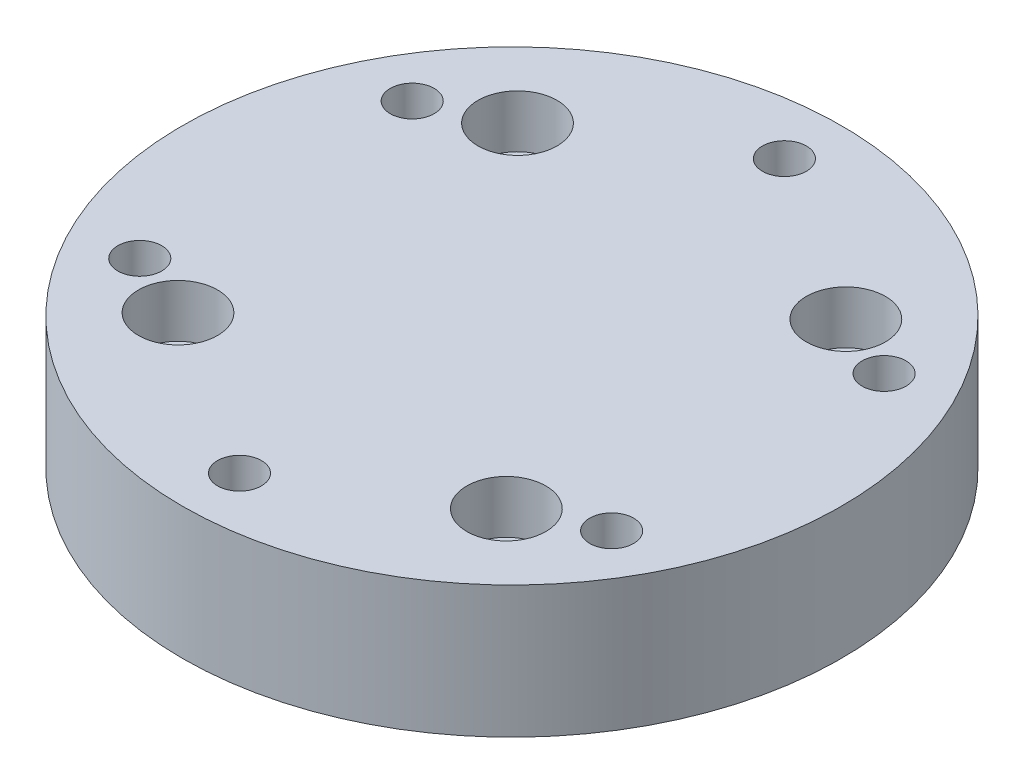
ISO-10303-21;
HEADER;
FILE_DESCRIPTION(('STEP AP214'),'2;1');
FILE_NAME('part.step','',(''),(''),'','','');
FILE_SCHEMA(('AUTOMOTIVE_DESIGN { 1 0 10303 214 1 1 1 1 }'));
ENDSEC;
DATA;
#1=APPLICATION_CONTEXT('core data for automotive mechanical design processes');
#2=APPLICATION_PROTOCOL_DEFINITION('international standard','automotive_design',2000,#1);
#3=PRODUCT_CONTEXT('',#1,'mechanical');
#4=PRODUCT('Part','Part','',(#3));
#5=PRODUCT_RELATED_PRODUCT_CATEGORY('part','',(#4));
#6=PRODUCT_DEFINITION_FORMATION('','',#4);
#7=PRODUCT_DEFINITION_CONTEXT('part definition',#1,'design');
#8=PRODUCT_DEFINITION('design','',#6,#7);
#9=PRODUCT_DEFINITION_SHAPE('','',#8);
#10=(LENGTH_UNIT() NAMED_UNIT(*) SI_UNIT(.MILLI.,.METRE.));
#11=(NAMED_UNIT(*) PLANE_ANGLE_UNIT() SI_UNIT($,.RADIAN.));
#12=(NAMED_UNIT(*) SI_UNIT($,.STERADIAN.) SOLID_ANGLE_UNIT());
#13=UNCERTAINTY_MEASURE_WITH_UNIT(LENGTH_MEASURE(1.E-05),#10,'distance_accuracy_value','');
#14=(GEOMETRIC_REPRESENTATION_CONTEXT(3) GLOBAL_UNCERTAINTY_ASSIGNED_CONTEXT((#13)) GLOBAL_UNIT_ASSIGNED_CONTEXT((#10,
#11,#12)) REPRESENTATION_CONTEXT('',''));
#15=CARTESIAN_POINT('',(0.,0.,0.));
#16=DIRECTION('',(0.,0.,1.));
#17=DIRECTION('',(1.,0.,0.));
#18=AXIS2_PLACEMENT_3D('',#15,#16,#17);
#19=CARTESIAN_POINT('',(-18.6792441284836,15.,-19.3154193791129));
#20=DIRECTION('',(0.,-1.,0.));
#21=DIRECTION('',(0.,0.,-1.));
#22=AXIS2_PLACEMENT_3D('',#19,#20,#21);
#23=CYLINDRICAL_SURFACE('',#22,2.5);
#24=CARTESIAN_POINT('',(-18.6792441284836,0.,-19.3154193791129));
#25=DIRECTION('',(0.,1.,0.));
#26=DIRECTION('',(0.,0.,1.));
#27=AXIS2_PLACEMENT_3D('',#24,#25,#26);
#28=CIRCLE('',#27,2.5);
#29=CARTESIAN_POINT('',(-18.6792441284836,0.,-16.8154193791129));
#30=VERTEX_POINT('',#29);
#31=EDGE_CURVE('E49',#30,#30,#28,.T.);
#32=ORIENTED_EDGE('',*,*,#31,.F.);
#33=EDGE_LOOP('',(#32));
#34=FACE_BOUND('',#33,.T.);
#35=CARTESIAN_POINT('',(-18.6792441284836,9.,-19.3154193791129));
#36=DIRECTION('',(0.,1.,0.));
#37=DIRECTION('',(0.,0.,1.));
#38=AXIS2_PLACEMENT_3D('',#35,#36,#37);
#39=CIRCLE('',#38,2.5);
#40=CARTESIAN_POINT('',(-18.6792441284836,9.,-16.8154193791129));
#41=VERTEX_POINT('',#40);
#42=EDGE_CURVE('E40',#41,#41,#39,.T.);
#43=ORIENTED_EDGE('',*,*,#42,.T.);
#44=EDGE_LOOP('',(#43));
#45=FACE_BOUND('',#44,.T.);
#46=ADVANCED_FACE('F36',(#34,#45),#23,.F.);
#47=CARTESIAN_POINT('',(19.3154193791129,15.,-18.6792441284836));
#48=DIRECTION('',(0.,-1.,0.));
#49=DIRECTION('',(0.,0.,-1.));
#50=AXIS2_PLACEMENT_3D('',#47,#48,#49);
#51=CYLINDRICAL_SURFACE('',#50,2.50000000000048);
#52=CARTESIAN_POINT('',(19.3154193791129,0.,-18.6792441284836));
#53=DIRECTION('',(0.,1.,0.));
#54=DIRECTION('',(0.,0.,1.));
#55=AXIS2_PLACEMENT_3D('',#52,#53,#54);
#56=CIRCLE('',#55,2.50000000000048);
#57=CARTESIAN_POINT('',(19.3154193791129,0.,-16.1792441284831));
#58=VERTEX_POINT('',#57);
#59=EDGE_CURVE('E74',#58,#58,#56,.T.);
#60=ORIENTED_EDGE('',*,*,#59,.F.);
#61=EDGE_LOOP('',(#60));
#62=FACE_BOUND('',#61,.T.);
#63=CARTESIAN_POINT('',(19.3154193791129,9.,-18.6792441284836));
#64=DIRECTION('',(0.,1.,0.));
#65=DIRECTION('',(0.,0.,1.));
#66=AXIS2_PLACEMENT_3D('',#63,#64,#65);
#67=CIRCLE('',#66,2.50000000000048);
#68=CARTESIAN_POINT('',(19.3154193791129,9.,-16.1792441284831));
#69=VERTEX_POINT('',#68);
#70=EDGE_CURVE('E60',#69,#69,#67,.T.);
#71=ORIENTED_EDGE('',*,*,#70,.T.);
#72=EDGE_LOOP('',(#71));
#73=FACE_BOUND('',#72,.T.);
#74=ADVANCED_FACE('F88',(#62,#73),#51,.F.);
#75=CARTESIAN_POINT('',(18.6792441284836,15.,19.3154193791129));
#76=DIRECTION('',(0.,-1.,0.));
#77=DIRECTION('',(0.,0.,-1.));
#78=AXIS2_PLACEMENT_3D('',#75,#76,#77);
#79=CYLINDRICAL_SURFACE('',#78,2.50000000000145);
#80=CARTESIAN_POINT('',(18.6792441284836,0.,19.3154193791129));
#81=DIRECTION('',(0.,1.,0.));
#82=DIRECTION('',(0.,0.,1.));
#83=AXIS2_PLACEMENT_3D('',#80,#81,#82);
#84=CIRCLE('',#83,2.50000000000145);
#85=CARTESIAN_POINT('',(18.6792441284836,0.,21.8154193791144));
#86=VERTEX_POINT('',#85);
#87=EDGE_CURVE('E69',#86,#86,#84,.T.);
#88=ORIENTED_EDGE('',*,*,#87,.F.);
#89=EDGE_LOOP('',(#88));
#90=FACE_BOUND('',#89,.T.);
#91=CARTESIAN_POINT('',(18.6792441284836,9.,19.3154193791129));
#92=DIRECTION('',(0.,1.,0.));
#93=DIRECTION('',(0.,0.,1.));
#94=AXIS2_PLACEMENT_3D('',#91,#92,#93);
#95=CIRCLE('',#94,2.50000000000145);
#96=CARTESIAN_POINT('',(18.6792441284836,9.,21.8154193791144));
#97=VERTEX_POINT('',#96);
#98=EDGE_CURVE('E57',#97,#97,#95,.T.);
#99=ORIENTED_EDGE('',*,*,#98,.T.);
#100=EDGE_LOOP('',(#99));
#101=FACE_BOUND('',#100,.T.);
#102=ADVANCED_FACE('F93',(#90,#101),#79,.F.);
#103=CARTESIAN_POINT('',(-19.3154193791129,15.,18.6792441284836));
#104=DIRECTION('',(0.,-1.,0.));
#105=DIRECTION('',(0.,0.,-1.));
#106=AXIS2_PLACEMENT_3D('',#103,#104,#105);
#107=CYLINDRICAL_SURFACE('',#106,2.50000000000097);
#108=CARTESIAN_POINT('',(-19.3154193791129,0.,18.6792441284836));
#109=DIRECTION('',(0.,1.,0.));
#110=DIRECTION('',(0.,0.,1.));
#111=AXIS2_PLACEMENT_3D('',#108,#109,#110);
#112=CIRCLE('',#111,2.50000000000097);
#113=CARTESIAN_POINT('',(-19.3154193791129,0.,21.1792441284846));
#114=VERTEX_POINT('',#113);
#115=EDGE_CURVE('E65',#114,#114,#112,.T.);
#116=ORIENTED_EDGE('',*,*,#115,.F.);
#117=EDGE_LOOP('',(#116));
#118=FACE_BOUND('',#117,.T.);
#119=CARTESIAN_POINT('',(-19.3154193791129,9.,18.6792441284836));
#120=DIRECTION('',(0.,1.,0.));
#121=DIRECTION('',(0.,0.,1.));
#122=AXIS2_PLACEMENT_3D('',#119,#120,#121);
#123=CIRCLE('',#122,2.50000000000097);
#124=CARTESIAN_POINT('',(-19.3154193791129,9.,21.1792441284846));
#125=VERTEX_POINT('',#124);
#126=EDGE_CURVE('E54',#125,#125,#123,.T.);
#127=ORIENTED_EDGE('',*,*,#126,.T.);
#128=EDGE_LOOP('',(#127));
#129=FACE_BOUND('',#128,.T.);
#130=ADVANCED_FACE('F100',(#118,#129),#107,.F.);
#131=CARTESIAN_POINT('',(0.,15.,0.));
#132=DIRECTION('',(0.,1.,0.));
#133=DIRECTION('',(0.,0.,1.));
#134=AXIS2_PLACEMENT_3D('',#131,#132,#133);
#135=PLANE('',#134);
#136=CARTESIAN_POINT('',(0.,15.,-31.));
#137=DIRECTION('',(0.,1.,0.));
#138=DIRECTION('',(0.,0.,1.));
#139=AXIS2_PLACEMENT_3D('',#136,#137,#138);
#140=CIRCLE('',#139,2.49999999999999);
#141=CARTESIAN_POINT('',(0.,15.,-28.5));
#142=VERTEX_POINT('',#141);
#143=EDGE_CURVE('E403',#142,#142,#140,.T.);
#144=ORIENTED_EDGE('',*,*,#143,.F.);
#145=EDGE_LOOP('',(#144));
#146=FACE_BOUND('',#145,.T.);
#147=CARTESIAN_POINT('',(26.8467875173183,15.,-15.5000000000011));
#148=DIRECTION('',(0.,1.,0.));
#149=DIRECTION('',(0.,0.,1.));
#150=AXIS2_PLACEMENT_3D('',#147,#148,#149);
#151=CIRCLE('',#150,2.49999999999999);
#152=CARTESIAN_POINT('',(26.8467875173183,15.,-13.0000000000012));
#153=VERTEX_POINT('',#152);
#154=EDGE_CURVE('E405',#153,#153,#151,.T.);
#155=ORIENTED_EDGE('',*,*,#154,.F.);
#156=EDGE_LOOP('',(#155));
#157=FACE_BOUND('',#156,.T.);
#158=CARTESIAN_POINT('',(26.8467875173196,15.,15.4999999999989));
#159=DIRECTION('',(0.,1.,0.));
#160=DIRECTION('',(0.,0.,1.));
#161=AXIS2_PLACEMENT_3D('',#158,#159,#160);
#162=CIRCLE('',#161,2.49999999999999);
#163=CARTESIAN_POINT('',(26.8467875173196,15.,17.9999999999988));
#164=VERTEX_POINT('',#163);
#165=EDGE_CURVE('E411',#164,#164,#162,.T.);
#166=ORIENTED_EDGE('',*,*,#165,.F.);
#167=EDGE_LOOP('',(#166));
#168=FACE_BOUND('',#167,.T.);
#169=CARTESIAN_POINT('',(2.6318297617955E-12,15.,31.));
#170=DIRECTION('',(0.,1.,0.));
#171=DIRECTION('',(0.,0.,1.));
#172=AXIS2_PLACEMENT_3D('',#169,#170,#171);
#173=CIRCLE('',#172,2.49999999999999);
#174=CARTESIAN_POINT('',(2.6318297617955E-12,15.,33.5));
#175=VERTEX_POINT('',#174);
#176=EDGE_CURVE('E415',#175,#175,#173,.T.);
#177=ORIENTED_EDGE('',*,*,#176,.F.);
#178=EDGE_LOOP('',(#177));
#179=FACE_BOUND('',#178,.T.);
#180=CARTESIAN_POINT('',(-26.8467875173156,15.,15.5000000000012));
#181=DIRECTION('',(0.,1.,0.));
#182=DIRECTION('',(0.,0.,1.));
#183=AXIS2_PLACEMENT_3D('',#180,#181,#182);
#184=CIRCLE('',#183,2.49999999999999);
#185=CARTESIAN_POINT('',(-26.8467875173156,15.,18.0000000000011));
#186=VERTEX_POINT('',#185);
#187=EDGE_CURVE('E419',#186,#186,#184,.T.);
#188=ORIENTED_EDGE('',*,*,#187,.F.);
#189=EDGE_LOOP('',(#188));
#190=FACE_BOUND('',#189,.T.);
#191=CARTESIAN_POINT('',(-26.8467875173169,15.,-15.4999999999989));
#192=DIRECTION('',(0.,1.,0.));
#193=DIRECTION('',(0.,0.,1.));
#194=AXIS2_PLACEMENT_3D('',#191,#192,#193);
#195=CIRCLE('',#194,2.49999999999999);
#196=CARTESIAN_POINT('',(-26.8467875173169,15.,-12.9999999999989));
#197=VERTEX_POINT('',#196);
#198=EDGE_CURVE('E137',#197,#197,#195,.T.);
#199=ORIENTED_EDGE('',*,*,#198,.F.);
#200=EDGE_LOOP('',(#199));
#201=FACE_BOUND('',#200,.T.);
#202=CARTESIAN_POINT('',(-19.3154193791119,15.,18.6792441284836));
#203=DIRECTION('',(0.,1.,0.));
#204=DIRECTION('',(0.,0.,1.));
#205=AXIS2_PLACEMENT_3D('',#202,#203,#204);
#206=CIRCLE('',#205,4.5);
#207=CARTESIAN_POINT('',(-19.3154193791119,15.,23.1792441284836));
#208=VERTEX_POINT('',#207);
#209=EDGE_CURVE('E136',#208,#208,#206,.T.);
#210=ORIENTED_EDGE('',*,*,#209,.F.);
#211=EDGE_LOOP('',(#210));
#212=FACE_BOUND('',#211,.T.);
#213=CARTESIAN_POINT('',(18.6792441284847,15.,19.3154193791119));
#214=DIRECTION('',(0.,1.,0.));
#215=DIRECTION('',(0.,0.,1.));
#216=AXIS2_PLACEMENT_3D('',#213,#214,#215);
#217=CIRCLE('',#216,4.5);
#218=CARTESIAN_POINT('',(18.6792441284847,15.,23.8154193791119));
#219=VERTEX_POINT('',#218);
#220=EDGE_CURVE('E155',#219,#219,#217,.T.);
#221=ORIENTED_EDGE('',*,*,#220,.F.);
#222=EDGE_LOOP('',(#221));
#223=FACE_BOUND('',#222,.T.);
#224=CARTESIAN_POINT('',(19.3154193791129,15.,-18.6792441284847));
#225=DIRECTION('',(0.,1.,0.));
#226=DIRECTION('',(0.,0.,1.));
#227=AXIS2_PLACEMENT_3D('',#224,#225,#226);
#228=CIRCLE('',#227,4.5);
#229=CARTESIAN_POINT('',(19.3154193791129,15.,-14.1792441284847));
#230=VERTEX_POINT('',#229);
#231=EDGE_CURVE('E149',#230,#230,#228,.T.);
#232=ORIENTED_EDGE('',*,*,#231,.F.);
#233=EDGE_LOOP('',(#232));
#234=FACE_BOUND('',#233,.T.);
#235=CARTESIAN_POINT('',(-18.6792441284836,15.,-19.3154193791129));
#236=DIRECTION('',(0.,1.,0.));
#237=DIRECTION('',(0.,0.,1.));
#238=AXIS2_PLACEMENT_3D('',#235,#236,#237);
#239=CIRCLE('',#238,4.5);
#240=CARTESIAN_POINT('',(-18.6792441284836,15.,-14.8154193791129));
#241=VERTEX_POINT('',#240);
#242=EDGE_CURVE('E77',#241,#241,#239,.T.);
#243=ORIENTED_EDGE('',*,*,#242,.F.);
#244=EDGE_LOOP('',(#243));
#245=FACE_BOUND('',#244,.T.);
#246=CARTESIAN_POINT('',(0.,15.,0.));
#247=DIRECTION('',(0.,1.,0.));
#248=DIRECTION('',(0.,0.,1.));
#249=AXIS2_PLACEMENT_3D('',#246,#247,#248);
#250=CIRCLE('',#249,37.5);
#251=CARTESIAN_POINT('',(0.,15.,37.5));
#252=VERTEX_POINT('',#251);
#253=EDGE_CURVE('E10',#252,#252,#250,.T.);
#254=ORIENTED_EDGE('',*,*,#253,.T.);
#255=EDGE_LOOP('',(#254));
#256=FACE_BOUND('',#255,.T.);
#257=ADVANCED_FACE('F98',(#146,#157,#168,#179,#190,#201,#212,#223,#234,#245,#256),#135,.T.);
#258=CARTESIAN_POINT('',(0.,0.,0.));
#259=DIRECTION('',(0.,1.,0.));
#260=DIRECTION('',(0.,0.,1.));
#261=AXIS2_PLACEMENT_3D('',#258,#259,#260);
#262=PLANE('',#261);
#263=CARTESIAN_POINT('',(0.,0.,-31.));
#264=DIRECTION('',(0.,1.,0.));
#265=DIRECTION('',(0.,0.,1.));
#266=AXIS2_PLACEMENT_3D('',#263,#264,#265);
#267=CIRCLE('',#266,2.5);
#268=CARTESIAN_POINT('',(0.,0.,-28.5));
#269=VERTEX_POINT('',#268);
#270=EDGE_CURVE('E112',#269,#269,#267,.T.);
#271=ORIENTED_EDGE('',*,*,#270,.T.);
#272=EDGE_LOOP('',(#271));
#273=FACE_BOUND('',#272,.T.);
#274=CARTESIAN_POINT('',(26.8467875173183,0.,-15.5000000000011));
#275=DIRECTION('',(0.,1.,0.));
#276=DIRECTION('',(0.,0.,1.));
#277=AXIS2_PLACEMENT_3D('',#274,#275,#276);
#278=CIRCLE('',#277,2.5);
#279=CARTESIAN_POINT('',(26.8467875173183,0.,-13.0000000000011));
#280=VERTEX_POINT('',#279);
#281=EDGE_CURVE('E116',#280,#280,#278,.T.);
#282=ORIENTED_EDGE('',*,*,#281,.T.);
#283=EDGE_LOOP('',(#282));
#284=FACE_BOUND('',#283,.T.);
#285=CARTESIAN_POINT('',(26.8467875173196,0.,15.4999999999989));
#286=DIRECTION('',(0.,1.,0.));
#287=DIRECTION('',(0.,0.,1.));
#288=AXIS2_PLACEMENT_3D('',#285,#286,#287);
#289=CIRCLE('',#288,2.5);
#290=CARTESIAN_POINT('',(26.8467875173196,0.,17.9999999999988));
#291=VERTEX_POINT('',#290);
#292=EDGE_CURVE('E120',#291,#291,#289,.T.);
#293=ORIENTED_EDGE('',*,*,#292,.T.);
#294=EDGE_LOOP('',(#293));
#295=FACE_BOUND('',#294,.T.);
#296=CARTESIAN_POINT('',(2.6318297617955E-12,0.,31.));
#297=DIRECTION('',(0.,1.,0.));
#298=DIRECTION('',(0.,0.,1.));
#299=AXIS2_PLACEMENT_3D('',#296,#297,#298);
#300=CIRCLE('',#299,2.5);
#301=CARTESIAN_POINT('',(2.6318297617955E-12,0.,33.5));
#302=VERTEX_POINT('',#301);
#303=EDGE_CURVE('E124',#302,#302,#300,.T.);
#304=ORIENTED_EDGE('',*,*,#303,.T.);
#305=EDGE_LOOP('',(#304));
#306=FACE_BOUND('',#305,.T.);
#307=CARTESIAN_POINT('',(-26.8467875173156,0.,15.5000000000012));
#308=DIRECTION('',(0.,1.,0.));
#309=DIRECTION('',(0.,0.,1.));
#310=AXIS2_PLACEMENT_3D('',#307,#308,#309);
#311=CIRCLE('',#310,2.5);
#312=CARTESIAN_POINT('',(-26.8467875173156,0.,18.0000000000011));
#313=VERTEX_POINT('',#312);
#314=EDGE_CURVE('E128',#313,#313,#311,.T.);
#315=ORIENTED_EDGE('',*,*,#314,.T.);
#316=EDGE_LOOP('',(#315));
#317=FACE_BOUND('',#316,.T.);
#318=CARTESIAN_POINT('',(-26.8467875173169,0.,-15.4999999999989));
#319=DIRECTION('',(0.,1.,0.));
#320=DIRECTION('',(0.,0.,1.));
#321=AXIS2_PLACEMENT_3D('',#318,#319,#320);
#322=CIRCLE('',#321,2.5);
#323=CARTESIAN_POINT('',(-26.8467875173169,0.,-12.9999999999989));
#324=VERTEX_POINT('',#323);
#325=EDGE_CURVE('E132',#324,#324,#322,.T.);
#326=ORIENTED_EDGE('',*,*,#325,.T.);
#327=EDGE_LOOP('',(#326));
#328=FACE_BOUND('',#327,.T.);
#329=CARTESIAN_POINT('',(0.,0.,0.));
#330=DIRECTION('',(0.,1.,0.));
#331=DIRECTION('',(0.,0.,1.));
#332=AXIS2_PLACEMENT_3D('',#329,#330,#331);
#333=CIRCLE('',#332,37.5);
#334=CARTESIAN_POINT('',(0.,0.,37.5));
#335=VERTEX_POINT('',#334);
#336=EDGE_CURVE('E44',#335,#335,#333,.T.);
#337=ORIENTED_EDGE('',*,*,#336,.F.);
#338=EDGE_LOOP('',(#337));
#339=FACE_BOUND('',#338,.T.);
#340=ORIENTED_EDGE('',*,*,#31,.T.);
#341=EDGE_LOOP('',(#340));
#342=FACE_BOUND('',#341,.T.);
#343=ORIENTED_EDGE('',*,*,#59,.T.);
#344=EDGE_LOOP('',(#343));
#345=FACE_BOUND('',#344,.T.);
#346=ORIENTED_EDGE('',*,*,#87,.T.);
#347=EDGE_LOOP('',(#346));
#348=FACE_BOUND('',#347,.T.);
#349=ORIENTED_EDGE('',*,*,#115,.T.);
#350=EDGE_LOOP('',(#349));
#351=FACE_BOUND('',#350,.T.);
#352=ADVANCED_FACE('F85',(#273,#284,#295,#306,#317,#328,#339,#342,#345,#348,#351),#262,.F.);
#353=CARTESIAN_POINT('',(0.,15.,0.));
#354=DIRECTION('',(0.,-1.,0.));
#355=DIRECTION('',(0.,0.,-1.));
#356=AXIS2_PLACEMENT_3D('',#353,#354,#355);
#357=CYLINDRICAL_SURFACE('',#356,37.5);
#358=ORIENTED_EDGE('',*,*,#253,.F.);
#359=EDGE_LOOP('',(#358));
#360=FACE_BOUND('',#359,.T.);
#361=ORIENTED_EDGE('',*,*,#336,.T.);
#362=EDGE_LOOP('',(#361));
#363=FACE_BOUND('',#362,.T.);
#364=ADVANCED_FACE('F38',(#360,#363),#357,.T.);
#365=CARTESIAN_POINT('',(-19.3154193791119,9.,18.6792441284836));
#366=DIRECTION('',(0.,1.,0.));
#367=DIRECTION('',(0.,0.,1.));
#368=AXIS2_PLACEMENT_3D('',#365,#366,#367);
#369=CYLINDRICAL_SURFACE('',#368,4.5);
#370=CARTESIAN_POINT('',(-19.3154193791119,9.,18.6792441284836));
#371=DIRECTION('',(0.,1.,0.));
#372=DIRECTION('',(0.,0.,1.));
#373=AXIS2_PLACEMENT_3D('',#370,#371,#372);
#374=CIRCLE('',#373,4.5);
#375=CARTESIAN_POINT('',(-19.3154193791119,9.,23.1792441284836));
#376=VERTEX_POINT('',#375);
#377=EDGE_CURVE('E140',#376,#376,#374,.T.);
#378=ORIENTED_EDGE('',*,*,#377,.F.);
#379=EDGE_LOOP('',(#378));
#380=FACE_BOUND('',#379,.T.);
#381=ORIENTED_EDGE('',*,*,#209,.T.);
#382=EDGE_LOOP('',(#381));
#383=FACE_BOUND('',#382,.T.);
#384=ADVANCED_FACE('F107',(#380,#383),#369,.F.);
#385=CARTESIAN_POINT('',(-19.3154193791119,9.,18.6792441284836));
#386=DIRECTION('',(0.,1.,0.));
#387=DIRECTION('',(0.,0.,1.));
#388=AXIS2_PLACEMENT_3D('',#385,#386,#387);
#389=PLANE('',#388);
#390=ORIENTED_EDGE('',*,*,#126,.F.);
#391=EDGE_LOOP('',(#390));
#392=FACE_BOUND('',#391,.T.);
#393=ORIENTED_EDGE('',*,*,#377,.T.);
#394=EDGE_LOOP('',(#393));
#395=FACE_BOUND('',#394,.T.);
#396=ADVANCED_FACE('F203',(#392,#395),#389,.T.);
#397=CARTESIAN_POINT('',(18.6792441284847,9.,19.3154193791119));
#398=DIRECTION('',(0.,1.,0.));
#399=DIRECTION('',(0.,0.,1.));
#400=AXIS2_PLACEMENT_3D('',#397,#398,#399);
#401=CYLINDRICAL_SURFACE('',#400,4.5);
#402=CARTESIAN_POINT('',(18.6792441284847,9.,19.3154193791119));
#403=DIRECTION('',(0.,1.,0.));
#404=DIRECTION('',(0.,0.,1.));
#405=AXIS2_PLACEMENT_3D('',#402,#403,#404);
#406=CIRCLE('',#405,4.5);
#407=CARTESIAN_POINT('',(18.6792441284847,9.,23.8154193791119));
#408=VERTEX_POINT('',#407);
#409=EDGE_CURVE('E152',#408,#408,#406,.T.);
#410=ORIENTED_EDGE('',*,*,#409,.F.);
#411=EDGE_LOOP('',(#410));
#412=FACE_BOUND('',#411,.T.);
#413=ORIENTED_EDGE('',*,*,#220,.T.);
#414=EDGE_LOOP('',(#413));
#415=FACE_BOUND('',#414,.T.);
#416=ADVANCED_FACE('F197',(#412,#415),#401,.F.);
#417=CARTESIAN_POINT('',(18.6792441284847,9.,19.3154193791119));
#418=DIRECTION('',(0.,1.,0.));
#419=DIRECTION('',(0.,0.,1.));
#420=AXIS2_PLACEMENT_3D('',#417,#418,#419);
#421=PLANE('',#420);
#422=ORIENTED_EDGE('',*,*,#98,.F.);
#423=EDGE_LOOP('',(#422));
#424=FACE_BOUND('',#423,.T.);
#425=ORIENTED_EDGE('',*,*,#409,.T.);
#426=EDGE_LOOP('',(#425));
#427=FACE_BOUND('',#426,.T.);
#428=ADVANCED_FACE('F194',(#424,#427),#421,.T.);
#429=CARTESIAN_POINT('',(19.3154193791129,9.,-18.6792441284847));
#430=DIRECTION('',(0.,1.,0.));
#431=DIRECTION('',(0.,0.,1.));
#432=AXIS2_PLACEMENT_3D('',#429,#430,#431);
#433=CYLINDRICAL_SURFACE('',#432,4.5);
#434=CARTESIAN_POINT('',(19.3154193791129,9.,-18.6792441284847));
#435=DIRECTION('',(0.,1.,0.));
#436=DIRECTION('',(0.,0.,1.));
#437=AXIS2_PLACEMENT_3D('',#434,#435,#436);
#438=CIRCLE('',#437,4.5);
#439=CARTESIAN_POINT('',(19.3154193791129,9.,-14.1792441284847));
#440=VERTEX_POINT('',#439);
#441=EDGE_CURVE('E146',#440,#440,#438,.T.);
#442=ORIENTED_EDGE('',*,*,#441,.F.);
#443=EDGE_LOOP('',(#442));
#444=FACE_BOUND('',#443,.T.);
#445=ORIENTED_EDGE('',*,*,#231,.T.);
#446=EDGE_LOOP('',(#445));
#447=FACE_BOUND('',#446,.T.);
#448=ADVANCED_FACE('F179',(#444,#447),#433,.F.);
#449=CARTESIAN_POINT('',(19.3154193791129,9.,-18.6792441284847));
#450=DIRECTION('',(0.,1.,0.));
#451=DIRECTION('',(0.,0.,1.));
#452=AXIS2_PLACEMENT_3D('',#449,#450,#451);
#453=PLANE('',#452);
#454=ORIENTED_EDGE('',*,*,#70,.F.);
#455=EDGE_LOOP('',(#454));
#456=FACE_BOUND('',#455,.T.);
#457=ORIENTED_EDGE('',*,*,#441,.T.);
#458=EDGE_LOOP('',(#457));
#459=FACE_BOUND('',#458,.T.);
#460=ADVANCED_FACE('F169',(#456,#459),#453,.T.);
#461=CARTESIAN_POINT('',(-18.6792441284836,9.,-19.3154193791129));
#462=DIRECTION('',(0.,1.,0.));
#463=DIRECTION('',(0.,0.,1.));
#464=AXIS2_PLACEMENT_3D('',#461,#462,#463);
#465=CYLINDRICAL_SURFACE('',#464,4.5);
#466=CARTESIAN_POINT('',(-18.6792441284836,9.,-19.3154193791129));
#467=DIRECTION('',(0.,1.,0.));
#468=DIRECTION('',(0.,0.,1.));
#469=AXIS2_PLACEMENT_3D('',#466,#467,#468);
#470=CIRCLE('',#469,4.5);
#471=CARTESIAN_POINT('',(-18.6792441284836,9.,-14.8154193791129));
#472=VERTEX_POINT('',#471);
#473=EDGE_CURVE('E58',#472,#472,#470,.T.);
#474=ORIENTED_EDGE('',*,*,#473,.F.);
#475=EDGE_LOOP('',(#474));
#476=FACE_BOUND('',#475,.T.);
#477=ORIENTED_EDGE('',*,*,#242,.T.);
#478=EDGE_LOOP('',(#477));
#479=FACE_BOUND('',#478,.T.);
#480=ADVANCED_FACE('F165',(#476,#479),#465,.F.);
#481=CARTESIAN_POINT('',(-18.6792441284836,9.,-19.3154193791129));
#482=DIRECTION('',(0.,1.,0.));
#483=DIRECTION('',(0.,0.,1.));
#484=AXIS2_PLACEMENT_3D('',#481,#482,#483);
#485=PLANE('',#484);
#486=ORIENTED_EDGE('',*,*,#42,.F.);
#487=EDGE_LOOP('',(#486));
#488=FACE_BOUND('',#487,.T.);
#489=ORIENTED_EDGE('',*,*,#473,.T.);
#490=EDGE_LOOP('',(#489));
#491=FACE_BOUND('',#490,.T.);
#492=ADVANCED_FACE('F168',(#488,#491),#485,.T.);
#493=CARTESIAN_POINT('',(-26.8467875173169,15.,-15.4999999999989));
#494=DIRECTION('',(0.,1.,0.));
#495=DIRECTION('',(0.,0.,1.));
#496=AXIS2_PLACEMENT_3D('',#493,#494,#495);
#497=CYLINDRICAL_SURFACE('',#496,2.49999999999999);
#498=ORIENTED_EDGE('',*,*,#325,.F.);
#499=EDGE_LOOP('',(#498));
#500=FACE_BOUND('',#499,.T.);
#501=ORIENTED_EDGE('',*,*,#198,.T.);
#502=EDGE_LOOP('',(#501));
#503=FACE_BOUND('',#502,.T.);
#504=ADVANCED_FACE('F176',(#500,#503),#497,.F.);
#505=CARTESIAN_POINT('',(-26.8467875173156,15.,15.5000000000012));
#506=DIRECTION('',(0.,1.,0.));
#507=DIRECTION('',(0.,0.,1.));
#508=AXIS2_PLACEMENT_3D('',#505,#506,#507);
#509=CYLINDRICAL_SURFACE('',#508,2.49999999999999);
#510=ORIENTED_EDGE('',*,*,#314,.F.);
#511=EDGE_LOOP('',(#510));
#512=FACE_BOUND('',#511,.T.);
#513=ORIENTED_EDGE('',*,*,#187,.T.);
#514=EDGE_LOOP('',(#513));
#515=FACE_BOUND('',#514,.T.);
#516=ADVANCED_FACE('F289',(#512,#515),#509,.F.);
#517=CARTESIAN_POINT('',(2.6318297617955E-12,15.,31.));
#518=DIRECTION('',(0.,1.,0.));
#519=DIRECTION('',(0.,0.,1.));
#520=AXIS2_PLACEMENT_3D('',#517,#518,#519);
#521=CYLINDRICAL_SURFACE('',#520,2.49999999999999);
#522=ORIENTED_EDGE('',*,*,#303,.F.);
#523=EDGE_LOOP('',(#522));
#524=FACE_BOUND('',#523,.T.);
#525=ORIENTED_EDGE('',*,*,#176,.T.);
#526=EDGE_LOOP('',(#525));
#527=FACE_BOUND('',#526,.T.);
#528=ADVANCED_FACE('F298',(#524,#527),#521,.F.);
#529=CARTESIAN_POINT('',(26.8467875173196,15.,15.4999999999989));
#530=DIRECTION('',(0.,1.,0.));
#531=DIRECTION('',(0.,0.,1.));
#532=AXIS2_PLACEMENT_3D('',#529,#530,#531);
#533=CYLINDRICAL_SURFACE('',#532,2.49999999999999);
#534=ORIENTED_EDGE('',*,*,#292,.F.);
#535=EDGE_LOOP('',(#534));
#536=FACE_BOUND('',#535,.T.);
#537=ORIENTED_EDGE('',*,*,#165,.T.);
#538=EDGE_LOOP('',(#537));
#539=FACE_BOUND('',#538,.T.);
#540=ADVANCED_FACE('F309',(#536,#539),#533,.F.);
#541=CARTESIAN_POINT('',(26.8467875173183,15.,-15.5000000000011));
#542=DIRECTION('',(0.,1.,0.));
#543=DIRECTION('',(0.,0.,1.));
#544=AXIS2_PLACEMENT_3D('',#541,#542,#543);
#545=CYLINDRICAL_SURFACE('',#544,2.49999999999999);
#546=ORIENTED_EDGE('',*,*,#281,.F.);
#547=EDGE_LOOP('',(#546));
#548=FACE_BOUND('',#547,.T.);
#549=ORIENTED_EDGE('',*,*,#154,.T.);
#550=EDGE_LOOP('',(#549));
#551=FACE_BOUND('',#550,.T.);
#552=ADVANCED_FACE('F321',(#548,#551),#545,.F.);
#553=CARTESIAN_POINT('',(0.,15.,-31.));
#554=DIRECTION('',(0.,1.,0.));
#555=DIRECTION('',(0.,0.,1.));
#556=AXIS2_PLACEMENT_3D('',#553,#554,#555);
#557=CYLINDRICAL_SURFACE('',#556,2.49999999999999);
#558=ORIENTED_EDGE('',*,*,#270,.F.);
#559=EDGE_LOOP('',(#558));
#560=FACE_BOUND('',#559,.T.);
#561=ORIENTED_EDGE('',*,*,#143,.T.);
#562=EDGE_LOOP('',(#561));
#563=FACE_BOUND('',#562,.T.);
#564=ADVANCED_FACE('F333',(#560,#563),#557,.F.);
#565=CLOSED_SHELL('',(#46,#74,#102,#130,#257,#352,#364,#384,#396,#416,#428,#448,#460,#480,#492,
#504,#516,#528,#540,#552,#564));
#566=MANIFOLD_SOLID_BREP('B2',#565);
#567=ADVANCED_BREP_SHAPE_REPRESENTATION('',(#18,#566),#14);
#568=SHAPE_DEFINITION_REPRESENTATION(#9,#567);
ENDSEC;
END-ISO-10303-21;
